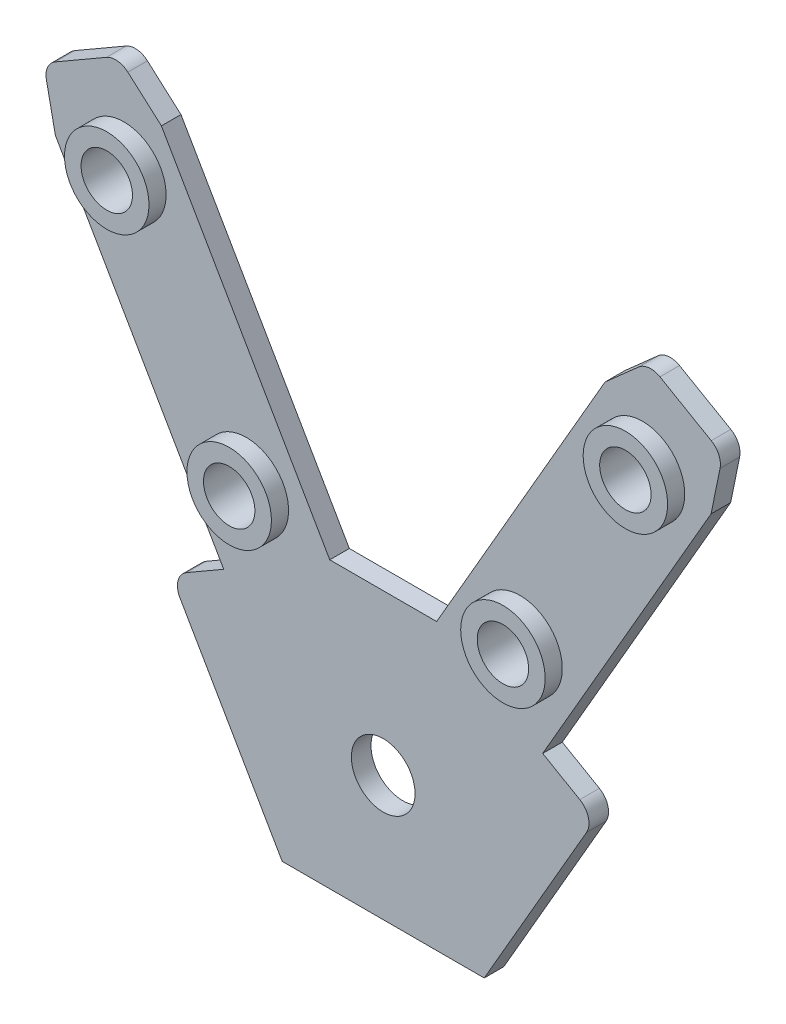
ISO-10303-21;
HEADER;
FILE_DESCRIPTION(('STEP AP214'),'2;1');
FILE_NAME('part.step','',(''),(''),'','','');
FILE_SCHEMA(('AUTOMOTIVE_DESIGN { 1 0 10303 214 1 1 1 1 }'));
ENDSEC;
DATA;
#1=APPLICATION_CONTEXT('core data for automotive mechanical design processes');
#2=APPLICATION_PROTOCOL_DEFINITION('international standard','automotive_design',2000,#1);
#3=PRODUCT_CONTEXT('',#1,'mechanical');
#4=PRODUCT('Part','Part','',(#3));
#5=PRODUCT_RELATED_PRODUCT_CATEGORY('part','',(#4));
#6=PRODUCT_DEFINITION_FORMATION('','',#4);
#7=PRODUCT_DEFINITION_CONTEXT('part definition',#1,'design');
#8=PRODUCT_DEFINITION('design','',#6,#7);
#9=PRODUCT_DEFINITION_SHAPE('','',#8);
#10=(LENGTH_UNIT() NAMED_UNIT(*) SI_UNIT(.MILLI.,.METRE.));
#11=(NAMED_UNIT(*) PLANE_ANGLE_UNIT() SI_UNIT($,.RADIAN.));
#12=(NAMED_UNIT(*) SI_UNIT($,.STERADIAN.) SOLID_ANGLE_UNIT());
#13=UNCERTAINTY_MEASURE_WITH_UNIT(LENGTH_MEASURE(1.E-05),#10,'distance_accuracy_value','');
#14=(GEOMETRIC_REPRESENTATION_CONTEXT(3) GLOBAL_UNCERTAINTY_ASSIGNED_CONTEXT((#13)) GLOBAL_UNIT_ASSIGNED_CONTEXT((#10,
#11,#12)) REPRESENTATION_CONTEXT('',''));
#15=CARTESIAN_POINT('',(0.,0.,0.));
#16=DIRECTION('',(0.,0.,1.));
#17=DIRECTION('',(1.,0.,0.));
#18=AXIS2_PLACEMENT_3D('',#15,#16,#17);
#19=CARTESIAN_POINT('',(-26.0396902753704,35.7643442304676,0.));
#20=DIRECTION('',(0.,0.,-1.));
#21=DIRECTION('',(-1.,0.,0.));
#22=AXIS2_PLACEMENT_3D('',#19,#20,#21);
#23=PLANE('',#22);
#24=CARTESIAN_POINT('',(0.,0.,0.));
#25=DIRECTION('',(0.,0.,1.));
#26=DIRECTION('',(1.,0.,0.));
#27=AXIS2_PLACEMENT_3D('',#24,#25,#26);
#28=CIRCLE('',#27,2.6);
#29=CARTESIAN_POINT('',(2.6,0.,0.));
#30=VERTEX_POINT('',#29);
#31=EDGE_CURVE('E493',#30,#30,#28,.T.);
#32=ORIENTED_EDGE('',*,*,#31,.T.);
#33=EDGE_LOOP('',(#32));
#34=FACE_BOUND('',#33,.T.);
#35=CARTESIAN_POINT('',(-26.0396902753704,35.7643442304676,0.));
#36=DIRECTION('',(0.,0.,1.));
#37=DIRECTION('',(-1.,0.,0.));
#38=AXIS2_PLACEMENT_3D('',#35,#36,#37);
#39=CIRCLE('',#38,1.5);
#40=CARTESIAN_POINT('',(-26.7896902753704,37.0633823361443,0.));
#41=VERTEX_POINT('',#40);
#42=CARTESIAN_POINT('',(-27.5092368542696,35.4636236750586,0.));
#43=VERTEX_POINT('',#42);
#44=EDGE_CURVE('E218',#41,#43,#39,.T.);
#45=ORIENTED_EDGE('',*,*,#44,.F.);
#46=DIRECTION('',(-0.866025403784442,-0.499999999999994,0.));
#47=VECTOR('',#46,1.);
#48=CARTESIAN_POINT('',(-22.6000998326207,39.4822435060601,0.));
#49=LINE('',#48,#47);
#50=CARTESIAN_POINT('',(-22.6000998326207,39.4822435060601,0.));
#51=VERTEX_POINT('',#50);
#52=EDGE_CURVE('E129',#51,#41,#49,.T.);
#53=ORIENTED_EDGE('',*,*,#52,.F.);
#54=CARTESIAN_POINT('',(-21.8500998326207,38.1832054003834,0.));
#55=DIRECTION('',(0.,0.,1.));
#56=DIRECTION('',(-1.,0.,0.));
#57=AXIS2_PLACEMENT_3D('',#54,#55,#56);
#58=CIRCLE('',#57,1.5);
#59=CARTESIAN_POINT('',(-20.8548949027467,39.3055097920501,0.));
#60=VERTEX_POINT('',#59);
#61=EDGE_CURVE('E123',#60,#51,#58,.T.);
#62=ORIENTED_EDGE('',*,*,#61,.F.);
#63=DIRECTION('',(-0.748202927777837,0.663469953249334,0.));
#64=VECTOR('',#63,1.);
#65=CARTESIAN_POINT('',(-18.1147680350733,36.8756986040721,0.));
#66=LINE('',#65,#64);
#67=CARTESIAN_POINT('',(-18.1147680350733,36.8756986040721,0.));
#68=VERTEX_POINT('',#67);
#69=EDGE_CURVE('E208',#68,#60,#66,.T.);
#70=ORIENTED_EDGE('',*,*,#69,.F.);
#71=DIRECTION('',(-0.499999999999994,0.866025403784442,0.));
#72=VECTOR('',#71,1.);
#73=CARTESIAN_POINT('',(-4.36476803507348,13.06,0.));
#74=LINE('',#73,#72);
#75=CARTESIAN_POINT('',(-4.36476803507348,13.06,0.));
#76=VERTEX_POINT('',#75);
#77=EDGE_CURVE('E256',#76,#68,#74,.T.);
#78=ORIENTED_EDGE('',*,*,#77,.F.);
#79=DIRECTION('',(-1.,0.,0.));
#80=VECTOR('',#79,1.);
#81=CARTESIAN_POINT('',(-4.36476803507348,13.06,0.));
#82=LINE('',#81,#80);
#83=CARTESIAN_POINT('',(4.36476803507348,13.06,0.));
#84=VERTEX_POINT('',#83);
#85=EDGE_CURVE('E254',#84,#76,#82,.T.);
#86=ORIENTED_EDGE('',*,*,#85,.F.);
#87=DIRECTION('',(-0.499999999999994,-0.866025403784442,0.));
#88=VECTOR('',#87,1.);
#89=CARTESIAN_POINT('',(4.36476803507348,13.06,0.));
#90=LINE('',#89,#88);
#91=CARTESIAN_POINT('',(18.1147680350733,36.8756986040721,0.));
#92=VERTEX_POINT('',#91);
#93=EDGE_CURVE('E252',#92,#84,#90,.T.);
#94=ORIENTED_EDGE('',*,*,#93,.F.);
#95=DIRECTION('',(-0.748202927777837,-0.663469953249334,0.));
#96=VECTOR('',#95,1.);
#97=CARTESIAN_POINT('',(18.1147680350733,36.8756986040721,0.));
#98=LINE('',#97,#96);
#99=CARTESIAN_POINT('',(20.8548949027467,39.3055097920501,0.));
#100=VERTEX_POINT('',#99);
#101=EDGE_CURVE('E250',#100,#92,#98,.T.);
#102=ORIENTED_EDGE('',*,*,#101,.F.);
#103=CARTESIAN_POINT('',(21.8500998326207,38.1832054003834,0.));
#104=DIRECTION('',(0.,0.,1.));
#105=DIRECTION('',(-1.,0.,0.));
#106=AXIS2_PLACEMENT_3D('',#103,#104,#105);
#107=CIRCLE('',#106,1.5);
#108=CARTESIAN_POINT('',(22.6000998326207,39.4822435060601,0.));
#109=VERTEX_POINT('',#108);
#110=EDGE_CURVE('E248',#109,#100,#107,.T.);
#111=ORIENTED_EDGE('',*,*,#110,.F.);
#112=DIRECTION('',(-0.866025403784442,0.499999999999994,0.));
#113=VECTOR('',#112,1.);
#114=CARTESIAN_POINT('',(22.6000998326207,39.4822435060601,0.));
#115=LINE('',#114,#113);
#116=CARTESIAN_POINT('',(26.7896902753704,37.0633823361443,0.));
#117=VERTEX_POINT('',#116);
#118=EDGE_CURVE('E246',#117,#109,#115,.T.);
#119=ORIENTED_EDGE('',*,*,#118,.F.);
#120=CARTESIAN_POINT('',(26.0396902753704,35.7643442304676,0.));
#121=DIRECTION('',(0.,0.,1.));
#122=DIRECTION('',(1.,0.,0.));
#123=AXIS2_PLACEMENT_3D('',#120,#121,#122);
#124=CIRCLE('',#123,1.5);
#125=CARTESIAN_POINT('',(27.5092368542696,35.4636236750586,0.));
#126=VERTEX_POINT('',#125);
#127=EDGE_CURVE('E244',#126,#117,#124,.T.);
#128=ORIENTED_EDGE('',*,*,#127,.F.);
#129=DIRECTION('',(0.200480370272667,0.97969771926617,0.));
#130=VECTOR('',#129,1.);
#131=CARTESIAN_POINT('',(26.7750220729177,31.8756986040722,0.));
#132=LINE('',#131,#130);
#133=CARTESIAN_POINT('',(26.7750220729177,31.8756986040722,0.));
#134=VERTEX_POINT('',#133);
#135=EDGE_CURVE('E242',#134,#126,#132,.T.);
#136=ORIENTED_EDGE('',*,*,#135,.F.);
#137=DIRECTION('',(0.499999999999995,0.866025403784442,0.));
#138=VECTOR('',#137,1.);
#139=CARTESIAN_POINT('',(13.0250220729179,8.06000000000005,0.));
#140=LINE('',#139,#138);
#141=CARTESIAN_POINT('',(13.0250220729179,8.06000000000005,0.));
#142=VERTEX_POINT('',#141);
#143=EDGE_CURVE('E240',#142,#134,#140,.T.);
#144=ORIENTED_EDGE('',*,*,#143,.F.);
#145=DIRECTION('',(-0.866025403784441,0.499999999999996,0.));
#146=VECTOR('',#145,1.);
#147=CARTESIAN_POINT('',(13.0250220729179,8.06000000000005,0.));
#148=LINE('',#147,#146);
#149=CARTESIAN_POINT('',(16.0561109861634,6.31000000000007,0.));
#150=VERTEX_POINT('',#149);
#151=EDGE_CURVE('E238',#150,#142,#148,.T.);
#152=ORIENTED_EDGE('',*,*,#151,.F.);
#153=CARTESIAN_POINT('',(15.3061109861634,5.01096189432341,0.));
#154=DIRECTION('',(0.,0.,1.));
#155=DIRECTION('',(-1.,0.,0.));
#156=AXIS2_PLACEMENT_3D('',#153,#154,#155);
#157=CIRCLE('',#156,1.49999999999999);
#158=CARTESIAN_POINT('',(16.6051490918401,4.26096189432342,0.));
#159=VERTEX_POINT('',#158);
#160=EDGE_CURVE('E236',#159,#150,#157,.T.);
#161=ORIENTED_EDGE('',*,*,#160,.F.);
#162=DIRECTION('',(0.499999999999994,0.866025403784442,0.));
#163=VECTOR('',#162,1.);
#164=CARTESIAN_POINT('',(16.6051490918401,4.26096189432342,0.));
#165=LINE('',#164,#163);
#166=CARTESIAN_POINT('',(8.2503353467198,-10.21,0.));
#167=VERTEX_POINT('',#166);
#168=EDGE_CURVE('E234',#167,#159,#165,.T.);
#169=ORIENTED_EDGE('',*,*,#168,.F.);
#170=DIRECTION('',(1.,0.,0.));
#171=VECTOR('',#170,1.);
#172=CARTESIAN_POINT('',(8.2503353467198,-10.21,0.));
#173=LINE('',#172,#171);
#174=CARTESIAN_POINT('',(-8.25033534671979,-10.21,0.));
#175=VERTEX_POINT('',#174);
#176=EDGE_CURVE('E232',#175,#167,#173,.T.);
#177=ORIENTED_EDGE('',*,*,#176,.F.);
#178=DIRECTION('',(0.499999999999995,-0.866025403784441,0.));
#179=VECTOR('',#178,1.);
#180=CARTESIAN_POINT('',(-16.6051490918401,4.26096189432341,0.));
#181=LINE('',#180,#179);
#182=CARTESIAN_POINT('',(-16.6051490918401,4.26096189432341,0.));
#183=VERTEX_POINT('',#182);
#184=EDGE_CURVE('E230',#183,#175,#181,.T.);
#185=ORIENTED_EDGE('',*,*,#184,.F.);
#186=CARTESIAN_POINT('',(-15.3061109861635,5.01096189432341,0.));
#187=DIRECTION('',(0.,0.,1.));
#188=DIRECTION('',(-1.,0.,0.));
#189=AXIS2_PLACEMENT_3D('',#186,#187,#188);
#190=CIRCLE('',#189,1.5);
#191=CARTESIAN_POINT('',(-16.0561109861634,6.31000000000008,0.));
#192=VERTEX_POINT('',#191);
#193=EDGE_CURVE('E228',#192,#183,#190,.T.);
#194=ORIENTED_EDGE('',*,*,#193,.F.);
#195=DIRECTION('',(-0.866025403784442,-0.499999999999994,0.));
#196=VECTOR('',#195,1.);
#197=CARTESIAN_POINT('',(-13.0250220729179,8.06000000000005,0.));
#198=LINE('',#197,#196);
#199=CARTESIAN_POINT('',(-13.0250220729179,8.06000000000005,0.));
#200=VERTEX_POINT('',#199);
#201=EDGE_CURVE('E226',#200,#192,#198,.T.);
#202=ORIENTED_EDGE('',*,*,#201,.F.);
#203=DIRECTION('',(0.499999999999995,-0.866025403784442,0.));
#204=VECTOR('',#203,1.);
#205=CARTESIAN_POINT('',(-13.0250220729179,8.06000000000005,0.));
#206=LINE('',#205,#204);
#207=CARTESIAN_POINT('',(-26.7750220729177,31.8756986040722,0.));
#208=VERTEX_POINT('',#207);
#209=EDGE_CURVE('E224',#208,#200,#206,.T.);
#210=ORIENTED_EDGE('',*,*,#209,.F.);
#211=DIRECTION('',(0.200480370272667,-0.979697719266169,0.));
#212=VECTOR('',#211,1.);
#213=CARTESIAN_POINT('',(-26.7750220729177,31.8756986040722,0.));
#214=LINE('',#213,#212);
#215=EDGE_CURVE('E221',#43,#208,#214,.T.);
#216=ORIENTED_EDGE('',*,*,#215,.F.);
#217=EDGE_LOOP('',(#45,#53,#62,#70,#78,#86,#94,#102,#111,#119,#128,#136,#144,#152,#161,#169,
#177,#185,#194,#202,#210,#216));
#218=FACE_BOUND('',#217,.T.);
#219=CARTESIAN_POINT('',(-21.1785571585147,32.1823370295497,0.));
#220=DIRECTION('',(0.,0.,1.));
#221=DIRECTION('',(1.,0.,0.));
#222=AXIS2_PLACEMENT_3D('',#219,#220,#221);
#223=CIRCLE('',#222,2.1);
#224=CARTESIAN_POINT('',(-19.0785571585147,32.1823370295497,0.));
#225=VERTEX_POINT('',#224);
#226=EDGE_CURVE('E509',#225,#225,#223,.T.);
#227=ORIENTED_EDGE('',*,*,#226,.T.);
#228=EDGE_LOOP('',(#227));
#229=FACE_BOUND('',#228,.T.);
#230=CARTESIAN_POINT('',(-11.1785571585147,14.8618289538609,0.));
#231=DIRECTION('',(0.,0.,1.));
#232=DIRECTION('',(1.,0.,0.));
#233=AXIS2_PLACEMENT_3D('',#230,#231,#232);
#234=CIRCLE('',#233,2.1);
#235=CARTESIAN_POINT('',(-9.07855715851474,14.8618289538609,0.));
#236=VERTEX_POINT('',#235);
#237=EDGE_CURVE('E515',#236,#236,#234,.T.);
#238=ORIENTED_EDGE('',*,*,#237,.T.);
#239=EDGE_LOOP('',(#238));
#240=FACE_BOUND('',#239,.T.);
#241=CARTESIAN_POINT('',(11.1785571585147,14.8618289538609,0.));
#242=DIRECTION('',(0.,0.,1.));
#243=DIRECTION('',(1.,0.,0.));
#244=AXIS2_PLACEMENT_3D('',#241,#242,#243);
#245=CIRCLE('',#244,2.1);
#246=CARTESIAN_POINT('',(13.2785571585147,14.8618289538609,0.));
#247=VERTEX_POINT('',#246);
#248=EDGE_CURVE('E521',#247,#247,#245,.T.);
#249=ORIENTED_EDGE('',*,*,#248,.T.);
#250=EDGE_LOOP('',(#249));
#251=FACE_BOUND('',#250,.T.);
#252=CARTESIAN_POINT('',(21.1785571585147,32.1823370295497,0.));
#253=DIRECTION('',(0.,0.,1.));
#254=DIRECTION('',(1.,0.,0.));
#255=AXIS2_PLACEMENT_3D('',#252,#253,#254);
#256=CIRCLE('',#255,2.1);
#257=CARTESIAN_POINT('',(23.2785571585148,32.1823370295497,0.));
#258=VERTEX_POINT('',#257);
#259=EDGE_CURVE('E527',#258,#258,#256,.T.);
#260=ORIENTED_EDGE('',*,*,#259,.T.);
#261=EDGE_LOOP('',(#260));
#262=FACE_BOUND('',#261,.T.);
#263=ADVANCED_FACE('F35',(#34,#218,#229,#240,#251,#262),#23,.T.);
#264=CARTESIAN_POINT('',(-26.0396902753704,35.7643442304676,1.6));
#265=DIRECTION('',(0.,0.,-1.));
#266=DIRECTION('',(-1.,0.,0.));
#267=AXIS2_PLACEMENT_3D('',#264,#265,#266);
#268=PLANE('',#267);
#269=CARTESIAN_POINT('',(-11.1785571585147,14.8618289538609,1.6));
#270=DIRECTION('',(0.,0.,-1.));
#271=DIRECTION('',(-1.,0.,0.));
#272=AXIS2_PLACEMENT_3D('',#269,#270,#271);
#273=CIRCLE('',#272,3.45);
#274=CARTESIAN_POINT('',(-14.6285571585147,14.8618289538609,1.6));
#275=VERTEX_POINT('',#274);
#276=EDGE_CURVE('E44',#275,#275,#273,.F.);
#277=ORIENTED_EDGE('',*,*,#276,.F.);
#278=EDGE_LOOP('',(#277));
#279=FACE_BOUND('',#278,.T.);
#280=CARTESIAN_POINT('',(21.1785571585147,32.1823370295497,1.6));
#281=DIRECTION('',(0.,0.,-1.));
#282=DIRECTION('',(-1.,0.,0.));
#283=AXIS2_PLACEMENT_3D('',#280,#281,#282);
#284=CIRCLE('',#283,3.45);
#285=CARTESIAN_POINT('',(17.7285571585148,32.1823370295497,1.6));
#286=VERTEX_POINT('',#285);
#287=EDGE_CURVE('E318',#286,#286,#284,.F.);
#288=ORIENTED_EDGE('',*,*,#287,.F.);
#289=EDGE_LOOP('',(#288));
#290=FACE_BOUND('',#289,.T.);
#291=CARTESIAN_POINT('',(-26.0396902753704,35.7643442304676,1.6));
#292=DIRECTION('',(0.,0.,1.));
#293=DIRECTION('',(-1.,0.,0.));
#294=AXIS2_PLACEMENT_3D('',#291,#292,#293);
#295=CIRCLE('',#294,1.5);
#296=CARTESIAN_POINT('',(-26.7896902753704,37.0633823361443,1.6));
#297=VERTEX_POINT('',#296);
#298=CARTESIAN_POINT('',(-27.5092368542696,35.4636236750586,1.6));
#299=VERTEX_POINT('',#298);
#300=EDGE_CURVE('E261',#297,#299,#295,.T.);
#301=ORIENTED_EDGE('',*,*,#300,.T.);
#302=DIRECTION('',(0.200480370272667,-0.979697719266169,0.));
#303=VECTOR('',#302,1.);
#304=CARTESIAN_POINT('',(-26.7750220729177,31.8756986040722,1.6));
#305=LINE('',#304,#303);
#306=CARTESIAN_POINT('',(-26.7750220729177,31.8756986040722,1.6));
#307=VERTEX_POINT('',#306);
#308=EDGE_CURVE('E138',#299,#307,#305,.T.);
#309=ORIENTED_EDGE('',*,*,#308,.T.);
#310=DIRECTION('',(0.499999999999995,-0.866025403784442,0.));
#311=VECTOR('',#310,1.);
#312=CARTESIAN_POINT('',(-13.0250220729179,8.06000000000005,1.6));
#313=LINE('',#312,#311);
#314=CARTESIAN_POINT('',(-13.0250220729179,8.06000000000005,1.6));
#315=VERTEX_POINT('',#314);
#316=EDGE_CURVE('E442',#307,#315,#313,.T.);
#317=ORIENTED_EDGE('',*,*,#316,.T.);
#318=DIRECTION('',(-0.866025403784442,-0.499999999999994,0.));
#319=VECTOR('',#318,1.);
#320=CARTESIAN_POINT('',(-13.0250220729179,8.06000000000005,1.6));
#321=LINE('',#320,#319);
#322=CARTESIAN_POINT('',(-16.0561109861634,6.31000000000008,1.6));
#323=VERTEX_POINT('',#322);
#324=EDGE_CURVE('E454',#315,#323,#321,.T.);
#325=ORIENTED_EDGE('',*,*,#324,.T.);
#326=CARTESIAN_POINT('',(-15.3061109861635,5.01096189432341,1.6));
#327=DIRECTION('',(0.,0.,1.));
#328=DIRECTION('',(-1.,0.,0.));
#329=AXIS2_PLACEMENT_3D('',#326,#327,#328);
#330=CIRCLE('',#329,1.5);
#331=CARTESIAN_POINT('',(-16.6051490918401,4.26096189432341,1.6));
#332=VERTEX_POINT('',#331);
#333=EDGE_CURVE('E451',#323,#332,#330,.T.);
#334=ORIENTED_EDGE('',*,*,#333,.T.);
#335=DIRECTION('',(0.499999999999995,-0.866025403784441,0.));
#336=VECTOR('',#335,1.);
#337=CARTESIAN_POINT('',(-16.6051490918401,4.26096189432341,1.6));
#338=LINE('',#337,#336);
#339=CARTESIAN_POINT('',(-8.25033534671979,-10.21,1.6));
#340=VERTEX_POINT('',#339);
#341=EDGE_CURVE('E453',#332,#340,#338,.T.);
#342=ORIENTED_EDGE('',*,*,#341,.T.);
#343=DIRECTION('',(1.,0.,0.));
#344=VECTOR('',#343,1.);
#345=CARTESIAN_POINT('',(8.2503353467198,-10.21,1.6));
#346=LINE('',#345,#344);
#347=CARTESIAN_POINT('',(8.2503353467198,-10.21,1.6));
#348=VERTEX_POINT('',#347);
#349=EDGE_CURVE('E456',#340,#348,#346,.T.);
#350=ORIENTED_EDGE('',*,*,#349,.T.);
#351=DIRECTION('',(0.499999999999994,0.866025403784442,0.));
#352=VECTOR('',#351,1.);
#353=CARTESIAN_POINT('',(16.6051490918401,4.26096189432342,1.6));
#354=LINE('',#353,#352);
#355=CARTESIAN_POINT('',(16.6051490918401,4.26096189432342,1.6));
#356=VERTEX_POINT('',#355);
#357=EDGE_CURVE('E462',#348,#356,#354,.T.);
#358=ORIENTED_EDGE('',*,*,#357,.T.);
#359=CARTESIAN_POINT('',(15.3061109861634,5.01096189432341,1.6));
#360=DIRECTION('',(0.,0.,1.));
#361=DIRECTION('',(-1.,0.,0.));
#362=AXIS2_PLACEMENT_3D('',#359,#360,#361);
#363=CIRCLE('',#362,1.49999999999999);
#364=CARTESIAN_POINT('',(16.0561109861634,6.31000000000007,1.6));
#365=VERTEX_POINT('',#364);
#366=EDGE_CURVE('E464',#356,#365,#363,.T.);
#367=ORIENTED_EDGE('',*,*,#366,.T.);
#368=DIRECTION('',(-0.866025403784441,0.499999999999996,0.));
#369=VECTOR('',#368,1.);
#370=CARTESIAN_POINT('',(13.0250220729179,8.06000000000005,1.6));
#371=LINE('',#370,#369);
#372=CARTESIAN_POINT('',(13.0250220729179,8.06000000000005,1.6));
#373=VERTEX_POINT('',#372);
#374=EDGE_CURVE('E466',#365,#373,#371,.T.);
#375=ORIENTED_EDGE('',*,*,#374,.T.);
#376=DIRECTION('',(0.499999999999995,0.866025403784442,0.));
#377=VECTOR('',#376,1.);
#378=CARTESIAN_POINT('',(13.0250220729179,8.06000000000005,1.6));
#379=LINE('',#378,#377);
#380=CARTESIAN_POINT('',(26.7750220729177,31.8756986040722,1.6));
#381=VERTEX_POINT('',#380);
#382=EDGE_CURVE('E468',#373,#381,#379,.T.);
#383=ORIENTED_EDGE('',*,*,#382,.T.);
#384=DIRECTION('',(0.200480370272667,0.97969771926617,0.));
#385=VECTOR('',#384,1.);
#386=CARTESIAN_POINT('',(26.7750220729177,31.8756986040722,1.6));
#387=LINE('',#386,#385);
#388=CARTESIAN_POINT('',(27.5092368542696,35.4636236750586,1.6));
#389=VERTEX_POINT('',#388);
#390=EDGE_CURVE('E470',#381,#389,#387,.T.);
#391=ORIENTED_EDGE('',*,*,#390,.T.);
#392=CARTESIAN_POINT('',(26.0396902753704,35.7643442304676,1.6));
#393=DIRECTION('',(0.,0.,1.));
#394=DIRECTION('',(1.,0.,0.));
#395=AXIS2_PLACEMENT_3D('',#392,#393,#394);
#396=CIRCLE('',#395,1.5);
#397=CARTESIAN_POINT('',(26.7896902753704,37.0633823361443,1.6));
#398=VERTEX_POINT('',#397);
#399=EDGE_CURVE('E472',#389,#398,#396,.T.);
#400=ORIENTED_EDGE('',*,*,#399,.T.);
#401=DIRECTION('',(-0.866025403784442,0.499999999999994,0.));
#402=VECTOR('',#401,1.);
#403=CARTESIAN_POINT('',(22.6000998326207,39.4822435060601,1.6));
#404=LINE('',#403,#402);
#405=CARTESIAN_POINT('',(22.6000998326207,39.4822435060601,1.6));
#406=VERTEX_POINT('',#405);
#407=EDGE_CURVE('E474',#398,#406,#404,.T.);
#408=ORIENTED_EDGE('',*,*,#407,.T.);
#409=CARTESIAN_POINT('',(21.8500998326207,38.1832054003834,1.6));
#410=DIRECTION('',(0.,0.,1.));
#411=DIRECTION('',(-1.,0.,0.));
#412=AXIS2_PLACEMENT_3D('',#409,#410,#411);
#413=CIRCLE('',#412,1.5);
#414=CARTESIAN_POINT('',(20.8548949027467,39.3055097920501,1.6));
#415=VERTEX_POINT('',#414);
#416=EDGE_CURVE('E476',#406,#415,#413,.T.);
#417=ORIENTED_EDGE('',*,*,#416,.T.);
#418=DIRECTION('',(-0.748202927777837,-0.663469953249334,0.));
#419=VECTOR('',#418,1.);
#420=CARTESIAN_POINT('',(18.1147680350733,36.8756986040721,1.6));
#421=LINE('',#420,#419);
#422=CARTESIAN_POINT('',(18.1147680350733,36.8756986040721,1.6));
#423=VERTEX_POINT('',#422);
#424=EDGE_CURVE('E478',#415,#423,#421,.T.);
#425=ORIENTED_EDGE('',*,*,#424,.T.);
#426=DIRECTION('',(-0.499999999999994,-0.866025403784442,0.));
#427=VECTOR('',#426,1.);
#428=CARTESIAN_POINT('',(4.36476803507348,13.06,1.6));
#429=LINE('',#428,#427);
#430=CARTESIAN_POINT('',(4.36476803507348,13.06,1.6));
#431=VERTEX_POINT('',#430);
#432=EDGE_CURVE('E480',#423,#431,#429,.T.);
#433=ORIENTED_EDGE('',*,*,#432,.T.);
#434=DIRECTION('',(-1.,0.,0.));
#435=VECTOR('',#434,1.);
#436=CARTESIAN_POINT('',(-4.36476803507348,13.06,1.6));
#437=LINE('',#436,#435);
#438=CARTESIAN_POINT('',(-4.36476803507348,13.06,1.6));
#439=VERTEX_POINT('',#438);
#440=EDGE_CURVE('E482',#431,#439,#437,.T.);
#441=ORIENTED_EDGE('',*,*,#440,.T.);
#442=DIRECTION('',(-0.499999999999994,0.866025403784442,0.));
#443=VECTOR('',#442,1.);
#444=CARTESIAN_POINT('',(-4.36476803507348,13.06,1.6));
#445=LINE('',#444,#443);
#446=CARTESIAN_POINT('',(-18.1147680350733,36.8756986040721,1.6));
#447=VERTEX_POINT('',#446);
#448=EDGE_CURVE('E200',#439,#447,#445,.T.);
#449=ORIENTED_EDGE('',*,*,#448,.T.);
#450=DIRECTION('',(-0.748202927777837,0.663469953249334,0.));
#451=VECTOR('',#450,1.);
#452=CARTESIAN_POINT('',(-18.1147680350733,36.8756986040721,1.6));
#453=LINE('',#452,#451);
#454=CARTESIAN_POINT('',(-20.8548949027467,39.3055097920501,1.6));
#455=VERTEX_POINT('',#454);
#456=EDGE_CURVE('E193',#447,#455,#453,.T.);
#457=ORIENTED_EDGE('',*,*,#456,.T.);
#458=CARTESIAN_POINT('',(-21.8500998326207,38.1832054003834,1.6));
#459=DIRECTION('',(0.,0.,1.));
#460=DIRECTION('',(-1.,0.,0.));
#461=AXIS2_PLACEMENT_3D('',#458,#459,#460);
#462=CIRCLE('',#461,1.5);
#463=CARTESIAN_POINT('',(-22.6000998326207,39.4822435060601,1.6));
#464=VERTEX_POINT('',#463);
#465=EDGE_CURVE('E198',#455,#464,#462,.T.);
#466=ORIENTED_EDGE('',*,*,#465,.T.);
#467=DIRECTION('',(-0.866025403784442,-0.499999999999994,0.));
#468=VECTOR('',#467,1.);
#469=CARTESIAN_POINT('',(-22.6000998326207,39.4822435060601,1.6));
#470=LINE('',#469,#468);
#471=EDGE_CURVE('E52',#464,#297,#470,.T.);
#472=ORIENTED_EDGE('',*,*,#471,.T.);
#473=EDGE_LOOP('',(#301,#309,#317,#325,#334,#342,#350,#358,#367,#375,#383,#391,#400,#408,#417,
#425,#433,#441,#449,#457,#466,#472));
#474=FACE_BOUND('',#473,.T.);
#475=CARTESIAN_POINT('',(0.,0.,1.6));
#476=DIRECTION('',(0.,0.,1.));
#477=DIRECTION('',(1.,0.,0.));
#478=AXIS2_PLACEMENT_3D('',#475,#476,#477);
#479=CIRCLE('',#478,2.6);
#480=CARTESIAN_POINT('',(2.6,0.,1.6));
#481=VERTEX_POINT('',#480);
#482=EDGE_CURVE('E222',#481,#481,#479,.T.);
#483=ORIENTED_EDGE('',*,*,#482,.F.);
#484=EDGE_LOOP('',(#483));
#485=FACE_BOUND('',#484,.T.);
#486=CARTESIAN_POINT('',(11.1785571585147,14.8618289538609,1.6));
#487=DIRECTION('',(0.,0.,-1.));
#488=DIRECTION('',(-1.,0.,0.));
#489=AXIS2_PLACEMENT_3D('',#486,#487,#488);
#490=CIRCLE('',#489,3.45);
#491=CARTESIAN_POINT('',(7.72855715851474,14.8618289538609,1.6));
#492=VERTEX_POINT('',#491);
#493=EDGE_CURVE('E321',#492,#492,#490,.F.);
#494=ORIENTED_EDGE('',*,*,#493,.F.);
#495=EDGE_LOOP('',(#494));
#496=FACE_BOUND('',#495,.T.);
#497=CARTESIAN_POINT('',(-21.1785571585147,32.1823370295497,1.6));
#498=DIRECTION('',(0.,0.,-1.));
#499=DIRECTION('',(-1.,0.,0.));
#500=AXIS2_PLACEMENT_3D('',#497,#498,#499);
#501=CIRCLE('',#500,3.45);
#502=CARTESIAN_POINT('',(-24.6285571585148,32.1823370295497,1.6));
#503=VERTEX_POINT('',#502);
#504=EDGE_CURVE('E11',#503,#503,#501,.F.);
#505=ORIENTED_EDGE('',*,*,#504,.F.);
#506=EDGE_LOOP('',(#505));
#507=FACE_BOUND('',#506,.T.);
#508=ADVANCED_FACE('F195',(#279,#290,#474,#485,#496,#507),#268,.F.);
#509=CARTESIAN_POINT('',(-26.0396902753704,35.7643442304676,1.6));
#510=DIRECTION('',(0.,0.,-1.));
#511=DIRECTION('',(-1.,0.,0.));
#512=AXIS2_PLACEMENT_3D('',#509,#510,#511);
#513=CYLINDRICAL_SURFACE('',#512,1.5);
#514=ORIENTED_EDGE('',*,*,#44,.T.);
#515=DIRECTION('',(0.,0.,-1.));
#516=VECTOR('',#515,1.);
#517=CARTESIAN_POINT('',(-27.5092368542696,35.4636236750586,1.6));
#518=LINE('',#517,#516);
#519=EDGE_CURVE('E316',#299,#43,#518,.T.);
#520=ORIENTED_EDGE('',*,*,#519,.F.);
#521=ORIENTED_EDGE('',*,*,#300,.F.);
#522=DIRECTION('',(0.,0.,-1.));
#523=VECTOR('',#522,1.);
#524=CARTESIAN_POINT('',(-26.7896902753704,37.0633823361443,1.6));
#525=LINE('',#524,#523);
#526=EDGE_CURVE('E214',#297,#41,#525,.T.);
#527=ORIENTED_EDGE('',*,*,#526,.T.);
#528=EDGE_LOOP('',(#514,#520,#521,#527));
#529=FACE_BOUND('',#528,.T.);
#530=ADVANCED_FACE('F37',(#529),#513,.T.);
#531=CARTESIAN_POINT('',(-26.7750220729177,31.8756986040722,1.6));
#532=DIRECTION('',(0.979697719266169,0.200480370272667,0.));
#533=DIRECTION('',(-0.200480370272667,0.97969771926617,0.));
#534=AXIS2_PLACEMENT_3D('',#531,#532,#533);
#535=PLANE('',#534);
#536=ORIENTED_EDGE('',*,*,#215,.T.);
#537=DIRECTION('',(0.,0.,-1.));
#538=VECTOR('',#537,1.);
#539=CARTESIAN_POINT('',(-26.7750220729177,31.8756986040722,1.6));
#540=LINE('',#539,#538);
#541=EDGE_CURVE('E313',#307,#208,#540,.T.);
#542=ORIENTED_EDGE('',*,*,#541,.F.);
#543=ORIENTED_EDGE('',*,*,#308,.F.);
#544=ORIENTED_EDGE('',*,*,#519,.T.);
#545=EDGE_LOOP('',(#536,#542,#543,#544));
#546=FACE_BOUND('',#545,.T.);
#547=ADVANCED_FACE('F430',(#546),#535,.F.);
#548=CARTESIAN_POINT('',(-13.0250220729179,8.06000000000005,1.6));
#549=DIRECTION('',(0.866025403784442,0.499999999999995,0.));
#550=DIRECTION('',(-0.499999999999995,0.866025403784442,0.));
#551=AXIS2_PLACEMENT_3D('',#548,#549,#550);
#552=PLANE('',#551);
#553=ORIENTED_EDGE('',*,*,#209,.T.);
#554=DIRECTION('',(0.,0.,-1.));
#555=VECTOR('',#554,1.);
#556=CARTESIAN_POINT('',(-13.0250220729179,8.06000000000005,1.6));
#557=LINE('',#556,#555);
#558=EDGE_CURVE('E310',#315,#200,#557,.T.);
#559=ORIENTED_EDGE('',*,*,#558,.F.);
#560=ORIENTED_EDGE('',*,*,#316,.F.);
#561=ORIENTED_EDGE('',*,*,#541,.T.);
#562=EDGE_LOOP('',(#553,#559,#560,#561));
#563=FACE_BOUND('',#562,.T.);
#564=ADVANCED_FACE('F427',(#563),#552,.F.);
#565=CARTESIAN_POINT('',(-13.0250220729179,8.06000000000005,1.6));
#566=DIRECTION('',(0.499999999999994,-0.866025403784442,0.));
#567=DIRECTION('',(0.866025403784442,0.499999999999994,0.));
#568=AXIS2_PLACEMENT_3D('',#565,#566,#567);
#569=PLANE('',#568);
#570=ORIENTED_EDGE('',*,*,#201,.T.);
#571=DIRECTION('',(0.,0.,-1.));
#572=VECTOR('',#571,1.);
#573=CARTESIAN_POINT('',(-16.0561109861634,6.31000000000008,1.6));
#574=LINE('',#573,#572);
#575=EDGE_CURVE('E307',#323,#192,#574,.T.);
#576=ORIENTED_EDGE('',*,*,#575,.F.);
#577=ORIENTED_EDGE('',*,*,#324,.F.);
#578=ORIENTED_EDGE('',*,*,#558,.T.);
#579=EDGE_LOOP('',(#570,#576,#577,#578));
#580=FACE_BOUND('',#579,.T.);
#581=ADVANCED_FACE('F423',(#580),#569,.F.);
#582=CARTESIAN_POINT('',(-15.3061109861635,5.01096189432341,1.6));
#583=DIRECTION('',(0.,0.,-1.));
#584=DIRECTION('',(-1.,0.,0.));
#585=AXIS2_PLACEMENT_3D('',#582,#583,#584);
#586=CYLINDRICAL_SURFACE('',#585,1.5);
#587=ORIENTED_EDGE('',*,*,#193,.T.);
#588=DIRECTION('',(0.,0.,-1.));
#589=VECTOR('',#588,1.);
#590=CARTESIAN_POINT('',(-16.6051490918401,4.26096189432341,1.6));
#591=LINE('',#590,#589);
#592=EDGE_CURVE('E304',#332,#183,#591,.T.);
#593=ORIENTED_EDGE('',*,*,#592,.F.);
#594=ORIENTED_EDGE('',*,*,#333,.F.);
#595=ORIENTED_EDGE('',*,*,#575,.T.);
#596=EDGE_LOOP('',(#587,#593,#594,#595));
#597=FACE_BOUND('',#596,.T.);
#598=ADVANCED_FACE('F419',(#597),#586,.T.);
#599=CARTESIAN_POINT('',(-16.6051490918401,4.26096189432341,1.6));
#600=DIRECTION('',(0.866025403784441,0.499999999999995,0.));
#601=DIRECTION('',(-0.499999999999995,0.866025403784441,0.));
#602=AXIS2_PLACEMENT_3D('',#599,#600,#601);
#603=PLANE('',#602);
#604=ORIENTED_EDGE('',*,*,#184,.T.);
#605=DIRECTION('',(0.,0.,-1.));
#606=VECTOR('',#605,1.);
#607=CARTESIAN_POINT('',(-8.25033534671979,-10.21,1.6));
#608=LINE('',#607,#606);
#609=EDGE_CURVE('E301',#340,#175,#608,.T.);
#610=ORIENTED_EDGE('',*,*,#609,.F.);
#611=ORIENTED_EDGE('',*,*,#341,.F.);
#612=ORIENTED_EDGE('',*,*,#592,.T.);
#613=EDGE_LOOP('',(#604,#610,#611,#612));
#614=FACE_BOUND('',#613,.T.);
#615=ADVANCED_FACE('F415',(#614),#603,.F.);
#616=CARTESIAN_POINT('',(8.2503353467198,-10.21,1.6));
#617=DIRECTION('',(0.,1.,0.));
#618=DIRECTION('',(0.,0.,1.));
#619=AXIS2_PLACEMENT_3D('',#616,#617,#618);
#620=PLANE('',#619);
#621=ORIENTED_EDGE('',*,*,#176,.T.);
#622=DIRECTION('',(0.,0.,-1.));
#623=VECTOR('',#622,1.);
#624=CARTESIAN_POINT('',(8.2503353467198,-10.21,1.6));
#625=LINE('',#624,#623);
#626=EDGE_CURVE('E298',#348,#167,#625,.T.);
#627=ORIENTED_EDGE('',*,*,#626,.F.);
#628=ORIENTED_EDGE('',*,*,#349,.F.);
#629=ORIENTED_EDGE('',*,*,#609,.T.);
#630=EDGE_LOOP('',(#621,#627,#628,#629));
#631=FACE_BOUND('',#630,.T.);
#632=ADVANCED_FACE('F411',(#631),#620,.F.);
#633=CARTESIAN_POINT('',(16.6051490918401,4.26096189432342,1.6));
#634=DIRECTION('',(-0.866025403784442,0.499999999999994,0.));
#635=DIRECTION('',(-0.499999999999994,-0.866025403784442,0.));
#636=AXIS2_PLACEMENT_3D('',#633,#634,#635);
#637=PLANE('',#636);
#638=ORIENTED_EDGE('',*,*,#168,.T.);
#639=DIRECTION('',(0.,0.,-1.));
#640=VECTOR('',#639,1.);
#641=CARTESIAN_POINT('',(16.6051490918401,4.26096189432342,1.6));
#642=LINE('',#641,#640);
#643=EDGE_CURVE('E295',#356,#159,#642,.T.);
#644=ORIENTED_EDGE('',*,*,#643,.F.);
#645=ORIENTED_EDGE('',*,*,#357,.F.);
#646=ORIENTED_EDGE('',*,*,#626,.T.);
#647=EDGE_LOOP('',(#638,#644,#645,#646));
#648=FACE_BOUND('',#647,.T.);
#649=ADVANCED_FACE('F407',(#648),#637,.F.);
#650=CARTESIAN_POINT('',(15.3061109861634,5.01096189432341,1.6));
#651=DIRECTION('',(0.,0.,-1.));
#652=DIRECTION('',(-1.,0.,0.));
#653=AXIS2_PLACEMENT_3D('',#650,#651,#652);
#654=CYLINDRICAL_SURFACE('',#653,1.49999999999999);
#655=ORIENTED_EDGE('',*,*,#160,.T.);
#656=DIRECTION('',(0.,0.,-1.));
#657=VECTOR('',#656,1.);
#658=CARTESIAN_POINT('',(16.0561109861634,6.31000000000007,1.6));
#659=LINE('',#658,#657);
#660=EDGE_CURVE('E292',#365,#150,#659,.T.);
#661=ORIENTED_EDGE('',*,*,#660,.F.);
#662=ORIENTED_EDGE('',*,*,#366,.F.);
#663=ORIENTED_EDGE('',*,*,#643,.T.);
#664=EDGE_LOOP('',(#655,#661,#662,#663));
#665=FACE_BOUND('',#664,.T.);
#666=ADVANCED_FACE('F403',(#665),#654,.T.);
#667=CARTESIAN_POINT('',(13.0250220729179,8.06000000000005,1.6));
#668=DIRECTION('',(-0.499999999999996,-0.866025403784441,0.));
#669=DIRECTION('',(0.866025403784441,-0.499999999999996,0.));
#670=AXIS2_PLACEMENT_3D('',#667,#668,#669);
#671=PLANE('',#670);
#672=ORIENTED_EDGE('',*,*,#151,.T.);
#673=DIRECTION('',(0.,0.,-1.));
#674=VECTOR('',#673,1.);
#675=CARTESIAN_POINT('',(13.0250220729179,8.06000000000005,1.6));
#676=LINE('',#675,#674);
#677=EDGE_CURVE('E289',#373,#142,#676,.T.);
#678=ORIENTED_EDGE('',*,*,#677,.F.);
#679=ORIENTED_EDGE('',*,*,#374,.F.);
#680=ORIENTED_EDGE('',*,*,#660,.T.);
#681=EDGE_LOOP('',(#672,#678,#679,#680));
#682=FACE_BOUND('',#681,.T.);
#683=ADVANCED_FACE('F399',(#682),#671,.F.);
#684=CARTESIAN_POINT('',(13.0250220729179,8.06000000000005,1.6));
#685=DIRECTION('',(-0.866025403784442,0.499999999999995,0.));
#686=DIRECTION('',(-0.499999999999995,-0.866025403784442,0.));
#687=AXIS2_PLACEMENT_3D('',#684,#685,#686);
#688=PLANE('',#687);
#689=ORIENTED_EDGE('',*,*,#143,.T.);
#690=DIRECTION('',(0.,0.,-1.));
#691=VECTOR('',#690,1.);
#692=CARTESIAN_POINT('',(26.7750220729177,31.8756986040722,1.6));
#693=LINE('',#692,#691);
#694=EDGE_CURVE('E286',#381,#134,#693,.T.);
#695=ORIENTED_EDGE('',*,*,#694,.F.);
#696=ORIENTED_EDGE('',*,*,#382,.F.);
#697=ORIENTED_EDGE('',*,*,#677,.T.);
#698=EDGE_LOOP('',(#689,#695,#696,#697));
#699=FACE_BOUND('',#698,.T.);
#700=ADVANCED_FACE('F395',(#699),#688,.F.);
#701=CARTESIAN_POINT('',(26.7750220729177,31.8756986040722,1.6));
#702=DIRECTION('',(-0.97969771926617,0.200480370272667,0.));
#703=DIRECTION('',(-0.200480370272667,-0.97969771926617,0.));
#704=AXIS2_PLACEMENT_3D('',#701,#702,#703);
#705=PLANE('',#704);
#706=ORIENTED_EDGE('',*,*,#135,.T.);
#707=DIRECTION('',(0.,0.,-1.));
#708=VECTOR('',#707,1.);
#709=CARTESIAN_POINT('',(27.5092368542696,35.4636236750586,1.6));
#710=LINE('',#709,#708);
#711=EDGE_CURVE('E283',#389,#126,#710,.T.);
#712=ORIENTED_EDGE('',*,*,#711,.F.);
#713=ORIENTED_EDGE('',*,*,#390,.F.);
#714=ORIENTED_EDGE('',*,*,#694,.T.);
#715=EDGE_LOOP('',(#706,#712,#713,#714));
#716=FACE_BOUND('',#715,.T.);
#717=ADVANCED_FACE('F391',(#716),#705,.F.);
#718=CARTESIAN_POINT('',(26.0396902753704,35.7643442304676,1.6));
#719=DIRECTION('',(0.,0.,-1.));
#720=DIRECTION('',(-1.,0.,0.));
#721=AXIS2_PLACEMENT_3D('',#718,#719,#720);
#722=CYLINDRICAL_SURFACE('',#721,1.5);
#723=ORIENTED_EDGE('',*,*,#127,.T.);
#724=DIRECTION('',(0.,0.,-1.));
#725=VECTOR('',#724,1.);
#726=CARTESIAN_POINT('',(26.7896902753704,37.0633823361443,1.6));
#727=LINE('',#726,#725);
#728=EDGE_CURVE('E280',#398,#117,#727,.T.);
#729=ORIENTED_EDGE('',*,*,#728,.F.);
#730=ORIENTED_EDGE('',*,*,#399,.F.);
#731=ORIENTED_EDGE('',*,*,#711,.T.);
#732=EDGE_LOOP('',(#723,#729,#730,#731));
#733=FACE_BOUND('',#732,.T.);
#734=ADVANCED_FACE('F387',(#733),#722,.T.);
#735=CARTESIAN_POINT('',(22.6000998326207,39.4822435060601,1.6));
#736=DIRECTION('',(-0.499999999999994,-0.866025403784442,0.));
#737=DIRECTION('',(0.866025403784442,-0.499999999999994,0.));
#738=AXIS2_PLACEMENT_3D('',#735,#736,#737);
#739=PLANE('',#738);
#740=ORIENTED_EDGE('',*,*,#118,.T.);
#741=DIRECTION('',(0.,0.,-1.));
#742=VECTOR('',#741,1.);
#743=CARTESIAN_POINT('',(22.6000998326207,39.4822435060601,1.6));
#744=LINE('',#743,#742);
#745=EDGE_CURVE('E277',#406,#109,#744,.T.);
#746=ORIENTED_EDGE('',*,*,#745,.F.);
#747=ORIENTED_EDGE('',*,*,#407,.F.);
#748=ORIENTED_EDGE('',*,*,#728,.T.);
#749=EDGE_LOOP('',(#740,#746,#747,#748));
#750=FACE_BOUND('',#749,.T.);
#751=ADVANCED_FACE('F383',(#750),#739,.F.);
#752=CARTESIAN_POINT('',(21.8500998326207,38.1832054003834,1.6));
#753=DIRECTION('',(0.,0.,-1.));
#754=DIRECTION('',(-1.,0.,0.));
#755=AXIS2_PLACEMENT_3D('',#752,#753,#754);
#756=CYLINDRICAL_SURFACE('',#755,1.5);
#757=ORIENTED_EDGE('',*,*,#110,.T.);
#758=DIRECTION('',(0.,0.,-1.));
#759=VECTOR('',#758,1.);
#760=CARTESIAN_POINT('',(20.8548949027467,39.3055097920501,1.6));
#761=LINE('',#760,#759);
#762=EDGE_CURVE('E274',#415,#100,#761,.T.);
#763=ORIENTED_EDGE('',*,*,#762,.F.);
#764=ORIENTED_EDGE('',*,*,#416,.F.);
#765=ORIENTED_EDGE('',*,*,#745,.T.);
#766=EDGE_LOOP('',(#757,#763,#764,#765));
#767=FACE_BOUND('',#766,.T.);
#768=ADVANCED_FACE('F379',(#767),#756,.T.);
#769=CARTESIAN_POINT('',(18.1147680350733,36.8756986040721,1.6));
#770=DIRECTION('',(0.663469953249334,-0.748202927777837,0.));
#771=DIRECTION('',(0.748202927777837,0.663469953249334,0.));
#772=AXIS2_PLACEMENT_3D('',#769,#770,#771);
#773=PLANE('',#772);
#774=ORIENTED_EDGE('',*,*,#101,.T.);
#775=DIRECTION('',(0.,0.,-1.));
#776=VECTOR('',#775,1.);
#777=CARTESIAN_POINT('',(18.1147680350733,36.8756986040721,1.6));
#778=LINE('',#777,#776);
#779=EDGE_CURVE('E271',#423,#92,#778,.T.);
#780=ORIENTED_EDGE('',*,*,#779,.F.);
#781=ORIENTED_EDGE('',*,*,#424,.F.);
#782=ORIENTED_EDGE('',*,*,#762,.T.);
#783=EDGE_LOOP('',(#774,#780,#781,#782));
#784=FACE_BOUND('',#783,.T.);
#785=ADVANCED_FACE('F375',(#784),#773,.F.);
#786=CARTESIAN_POINT('',(4.36476803507348,13.06,1.6));
#787=DIRECTION('',(0.866025403784442,-0.499999999999994,0.));
#788=DIRECTION('',(0.499999999999994,0.866025403784442,0.));
#789=AXIS2_PLACEMENT_3D('',#786,#787,#788);
#790=PLANE('',#789);
#791=ORIENTED_EDGE('',*,*,#93,.T.);
#792=DIRECTION('',(0.,0.,-1.));
#793=VECTOR('',#792,1.);
#794=CARTESIAN_POINT('',(4.36476803507348,13.06,1.6));
#795=LINE('',#794,#793);
#796=EDGE_CURVE('E268',#431,#84,#795,.T.);
#797=ORIENTED_EDGE('',*,*,#796,.F.);
#798=ORIENTED_EDGE('',*,*,#432,.F.);
#799=ORIENTED_EDGE('',*,*,#779,.T.);
#800=EDGE_LOOP('',(#791,#797,#798,#799));
#801=FACE_BOUND('',#800,.T.);
#802=ADVANCED_FACE('F371',(#801),#790,.F.);
#803=CARTESIAN_POINT('',(-4.36476803507348,13.06,1.6));
#804=DIRECTION('',(0.,-1.,0.));
#805=DIRECTION('',(0.,0.,-1.));
#806=AXIS2_PLACEMENT_3D('',#803,#804,#805);
#807=PLANE('',#806);
#808=ORIENTED_EDGE('',*,*,#85,.T.);
#809=DIRECTION('',(0.,0.,-1.));
#810=VECTOR('',#809,1.);
#811=CARTESIAN_POINT('',(-4.36476803507348,13.06,1.6));
#812=LINE('',#811,#810);
#813=EDGE_CURVE('E265',#439,#76,#812,.T.);
#814=ORIENTED_EDGE('',*,*,#813,.F.);
#815=ORIENTED_EDGE('',*,*,#440,.F.);
#816=ORIENTED_EDGE('',*,*,#796,.T.);
#817=EDGE_LOOP('',(#808,#814,#815,#816));
#818=FACE_BOUND('',#817,.T.);
#819=ADVANCED_FACE('F367',(#818),#807,.F.);
#820=CARTESIAN_POINT('',(-4.36476803507348,13.06,1.6));
#821=DIRECTION('',(-0.866025403784442,-0.499999999999994,0.));
#822=DIRECTION('',(0.499999999999994,-0.866025403784442,0.));
#823=AXIS2_PLACEMENT_3D('',#820,#821,#822);
#824=PLANE('',#823);
#825=ORIENTED_EDGE('',*,*,#77,.T.);
#826=DIRECTION('',(0.,0.,-1.));
#827=VECTOR('',#826,1.);
#828=CARTESIAN_POINT('',(-18.1147680350733,36.8756986040721,1.6));
#829=LINE('',#828,#827);
#830=EDGE_CURVE('E209',#447,#68,#829,.T.);
#831=ORIENTED_EDGE('',*,*,#830,.F.);
#832=ORIENTED_EDGE('',*,*,#448,.F.);
#833=ORIENTED_EDGE('',*,*,#813,.T.);
#834=EDGE_LOOP('',(#825,#831,#832,#833));
#835=FACE_BOUND('',#834,.T.);
#836=ADVANCED_FACE('F364',(#835),#824,.F.);
#837=CARTESIAN_POINT('',(-18.1147680350733,36.8756986040721,1.6));
#838=DIRECTION('',(-0.663469953249334,-0.748202927777837,0.));
#839=DIRECTION('',(0.748202927777837,-0.663469953249334,0.));
#840=AXIS2_PLACEMENT_3D('',#837,#838,#839);
#841=PLANE('',#840);
#842=ORIENTED_EDGE('',*,*,#69,.T.);
#843=DIRECTION('',(0.,0.,-1.));
#844=VECTOR('',#843,1.);
#845=CARTESIAN_POINT('',(-20.8548949027467,39.3055097920501,1.6));
#846=LINE('',#845,#844);
#847=EDGE_CURVE('E205',#455,#60,#846,.T.);
#848=ORIENTED_EDGE('',*,*,#847,.F.);
#849=ORIENTED_EDGE('',*,*,#456,.F.);
#850=ORIENTED_EDGE('',*,*,#830,.T.);
#851=EDGE_LOOP('',(#842,#848,#849,#850));
#852=FACE_BOUND('',#851,.T.);
#853=ADVANCED_FACE('F206',(#852),#841,.F.);
#854=CARTESIAN_POINT('',(-21.8500998326207,38.1832054003834,1.6));
#855=DIRECTION('',(0.,0.,-1.));
#856=DIRECTION('',(-1.,0.,0.));
#857=AXIS2_PLACEMENT_3D('',#854,#855,#856);
#858=CYLINDRICAL_SURFACE('',#857,1.5);
#859=ORIENTED_EDGE('',*,*,#61,.T.);
#860=DIRECTION('',(0.,0.,-1.));
#861=VECTOR('',#860,1.);
#862=CARTESIAN_POINT('',(-22.6000998326207,39.4822435060601,1.6));
#863=LINE('',#862,#861);
#864=EDGE_CURVE('E210',#464,#51,#863,.T.);
#865=ORIENTED_EDGE('',*,*,#864,.F.);
#866=ORIENTED_EDGE('',*,*,#465,.F.);
#867=ORIENTED_EDGE('',*,*,#847,.T.);
#868=EDGE_LOOP('',(#859,#865,#866,#867));
#869=FACE_BOUND('',#868,.T.);
#870=ADVANCED_FACE('F212',(#869),#858,.T.);
#871=CARTESIAN_POINT('',(-22.6000998326207,39.4822435060601,1.6));
#872=DIRECTION('',(0.499999999999994,-0.866025403784442,0.));
#873=DIRECTION('',(0.866025403784442,0.499999999999994,0.));
#874=AXIS2_PLACEMENT_3D('',#871,#872,#873);
#875=PLANE('',#874);
#876=ORIENTED_EDGE('',*,*,#52,.T.);
#877=ORIENTED_EDGE('',*,*,#526,.F.);
#878=ORIENTED_EDGE('',*,*,#471,.F.);
#879=ORIENTED_EDGE('',*,*,#864,.T.);
#880=EDGE_LOOP('',(#876,#877,#878,#879));
#881=FACE_BOUND('',#880,.T.);
#882=ADVANCED_FACE('F346',(#881),#875,.F.);
#883=CARTESIAN_POINT('',(0.,0.,1.6));
#884=DIRECTION('',(0.,0.,-1.));
#885=DIRECTION('',(-1.,0.,0.));
#886=AXIS2_PLACEMENT_3D('',#883,#884,#885);
#887=CYLINDRICAL_SURFACE('',#886,2.6);
#888=ORIENTED_EDGE('',*,*,#482,.T.);
#889=EDGE_LOOP('',(#888));
#890=FACE_BOUND('',#889,.T.);
#891=ORIENTED_EDGE('',*,*,#31,.F.);
#892=EDGE_LOOP('',(#891));
#893=FACE_BOUND('',#892,.T.);
#894=ADVANCED_FACE('F336',(#890,#893),#887,.F.);
#895=CARTESIAN_POINT('',(21.1785571585147,32.1823370295497,3.));
#896=DIRECTION('',(0.,0.,-1.));
#897=DIRECTION('',(-1.,0.,0.));
#898=AXIS2_PLACEMENT_3D('',#895,#896,#897);
#899=CYLINDRICAL_SURFACE('',#898,3.45);
#900=CARTESIAN_POINT('',(21.1785571585147,32.1823370295497,3.));
#901=DIRECTION('',(0.,0.,1.));
#902=DIRECTION('',(-1.,0.,0.));
#903=AXIS2_PLACEMENT_3D('',#900,#901,#902);
#904=CIRCLE('',#903,3.45);
#905=CARTESIAN_POINT('',(17.7285571585148,32.1823370295497,3.));
#906=VERTEX_POINT('',#905);
#907=EDGE_CURVE('E495',#906,#906,#904,.T.);
#908=ORIENTED_EDGE('',*,*,#907,.F.);
#909=EDGE_LOOP('',(#908));
#910=FACE_BOUND('',#909,.T.);
#911=ORIENTED_EDGE('',*,*,#287,.T.);
#912=EDGE_LOOP('',(#911));
#913=FACE_BOUND('',#912,.T.);
#914=ADVANCED_FACE('F333',(#910,#913),#899,.T.);
#915=CARTESIAN_POINT('',(21.1785571585147,32.1823370295497,3.));
#916=DIRECTION('',(0.,0.,-1.));
#917=DIRECTION('',(-1.,0.,0.));
#918=AXIS2_PLACEMENT_3D('',#915,#916,#917);
#919=PLANE('',#918);
#920=CARTESIAN_POINT('',(21.1785571585147,32.1823370295497,3.));
#921=DIRECTION('',(0.,0.,1.));
#922=DIRECTION('',(1.,0.,0.));
#923=AXIS2_PLACEMENT_3D('',#920,#921,#922);
#924=CIRCLE('',#923,2.1);
#925=CARTESIAN_POINT('',(23.2785571585148,32.1823370295497,3.));
#926=VERTEX_POINT('',#925);
#927=EDGE_CURVE('E530',#926,#926,#924,.T.);
#928=ORIENTED_EDGE('',*,*,#927,.F.);
#929=EDGE_LOOP('',(#928));
#930=FACE_BOUND('',#929,.T.);
#931=ORIENTED_EDGE('',*,*,#907,.T.);
#932=EDGE_LOOP('',(#931));
#933=FACE_BOUND('',#932,.T.);
#934=ADVANCED_FACE('F335',(#930,#933),#919,.F.);
#935=CARTESIAN_POINT('',(11.1785571585147,14.8618289538609,3.));
#936=DIRECTION('',(0.,0.,-1.));
#937=DIRECTION('',(-1.,0.,0.));
#938=AXIS2_PLACEMENT_3D('',#935,#936,#937);
#939=CYLINDRICAL_SURFACE('',#938,3.45);
#940=CARTESIAN_POINT('',(11.1785571585147,14.8618289538609,3.));
#941=DIRECTION('',(0.,0.,1.));
#942=DIRECTION('',(-1.,0.,0.));
#943=AXIS2_PLACEMENT_3D('',#940,#941,#942);
#944=CIRCLE('',#943,3.45);
#945=CARTESIAN_POINT('',(7.72855715851474,14.8618289538609,3.));
#946=VERTEX_POINT('',#945);
#947=EDGE_CURVE('E500',#946,#946,#944,.T.);
#948=ORIENTED_EDGE('',*,*,#947,.F.);
#949=EDGE_LOOP('',(#948));
#950=FACE_BOUND('',#949,.T.);
#951=ORIENTED_EDGE('',*,*,#493,.T.);
#952=EDGE_LOOP('',(#951));
#953=FACE_BOUND('',#952,.T.);
#954=ADVANCED_FACE('F343',(#950,#953),#939,.T.);
#955=CARTESIAN_POINT('',(11.1785571585147,14.8618289538609,3.));
#956=DIRECTION('',(0.,0.,-1.));
#957=DIRECTION('',(-1.,0.,0.));
#958=AXIS2_PLACEMENT_3D('',#955,#956,#957);
#959=PLANE('',#958);
#960=CARTESIAN_POINT('',(11.1785571585147,14.8618289538609,3.));
#961=DIRECTION('',(0.,0.,1.));
#962=DIRECTION('',(1.,0.,0.));
#963=AXIS2_PLACEMENT_3D('',#960,#961,#962);
#964=CIRCLE('',#963,2.1);
#965=CARTESIAN_POINT('',(13.2785571585147,14.8618289538609,3.));
#966=VERTEX_POINT('',#965);
#967=EDGE_CURVE('E524',#966,#966,#964,.T.);
#968=ORIENTED_EDGE('',*,*,#967,.F.);
#969=EDGE_LOOP('',(#968));
#970=FACE_BOUND('',#969,.T.);
#971=ORIENTED_EDGE('',*,*,#947,.T.);
#972=EDGE_LOOP('',(#971));
#973=FACE_BOUND('',#972,.T.);
#974=ADVANCED_FACE('F569',(#970,#973),#959,.F.);
#975=CARTESIAN_POINT('',(-11.1785571585147,14.8618289538609,3.));
#976=DIRECTION('',(0.,0.,-1.));
#977=DIRECTION('',(-1.,0.,0.));
#978=AXIS2_PLACEMENT_3D('',#975,#976,#977);
#979=CYLINDRICAL_SURFACE('',#978,3.45);
#980=CARTESIAN_POINT('',(-11.1785571585147,14.8618289538609,3.));
#981=DIRECTION('',(0.,0.,1.));
#982=DIRECTION('',(1.,0.,0.));
#983=AXIS2_PLACEMENT_3D('',#980,#981,#982);
#984=CIRCLE('',#983,3.45);
#985=CARTESIAN_POINT('',(-7.72855715851474,14.8618289538609,3.));
#986=VERTEX_POINT('',#985);
#987=EDGE_CURVE('E503',#986,#986,#984,.T.);
#988=ORIENTED_EDGE('',*,*,#987,.F.);
#989=EDGE_LOOP('',(#988));
#990=FACE_BOUND('',#989,.T.);
#991=ORIENTED_EDGE('',*,*,#276,.T.);
#992=EDGE_LOOP('',(#991));
#993=FACE_BOUND('',#992,.T.);
#994=ADVANCED_FACE('F326',(#990,#993),#979,.T.);
#995=CARTESIAN_POINT('',(-11.1785571585147,14.8618289538609,3.));
#996=DIRECTION('',(0.,0.,1.));
#997=DIRECTION('',(1.,0.,0.));
#998=AXIS2_PLACEMENT_3D('',#995,#996,#997);
#999=PLANE('',#998);
#1000=CARTESIAN_POINT('',(-11.1785571585147,14.8618289538609,3.));
#1001=DIRECTION('',(0.,0.,1.));
#1002=DIRECTION('',(1.,0.,0.));
#1003=AXIS2_PLACEMENT_3D('',#1000,#1001,#1002);
#1004=CIRCLE('',#1003,2.1);
#1005=CARTESIAN_POINT('',(-9.07855715851474,14.8618289538609,3.));
#1006=VERTEX_POINT('',#1005);
#1007=EDGE_CURVE('E518',#1006,#1006,#1004,.T.);
#1008=ORIENTED_EDGE('',*,*,#1007,.F.);
#1009=EDGE_LOOP('',(#1008));
#1010=FACE_BOUND('',#1009,.T.);
#1011=ORIENTED_EDGE('',*,*,#987,.T.);
#1012=EDGE_LOOP('',(#1011));
#1013=FACE_BOUND('',#1012,.T.);
#1014=ADVANCED_FACE('F562',(#1010,#1013),#999,.T.);
#1015=CARTESIAN_POINT('',(-21.1785571585147,32.1823370295497,3.));
#1016=DIRECTION('',(0.,0.,-1.));
#1017=DIRECTION('',(-1.,0.,0.));
#1018=AXIS2_PLACEMENT_3D('',#1015,#1016,#1017);
#1019=CYLINDRICAL_SURFACE('',#1018,3.45);
#1020=CARTESIAN_POINT('',(-21.1785571585147,32.1823370295497,3.));
#1021=DIRECTION('',(0.,0.,1.));
#1022=DIRECTION('',(1.,0.,0.));
#1023=AXIS2_PLACEMENT_3D('',#1020,#1021,#1022);
#1024=CIRCLE('',#1023,3.45);
#1025=CARTESIAN_POINT('',(-17.7285571585148,32.1823370295497,3.));
#1026=VERTEX_POINT('',#1025);
#1027=EDGE_CURVE('E506',#1026,#1026,#1024,.T.);
#1028=ORIENTED_EDGE('',*,*,#1027,.F.);
#1029=EDGE_LOOP('',(#1028));
#1030=FACE_BOUND('',#1029,.T.);
#1031=ORIENTED_EDGE('',*,*,#504,.T.);
#1032=EDGE_LOOP('',(#1031));
#1033=FACE_BOUND('',#1032,.T.);
#1034=ADVANCED_FACE('F558',(#1030,#1033),#1019,.T.);
#1035=CARTESIAN_POINT('',(-21.1785571585147,32.1823370295497,3.));
#1036=DIRECTION('',(0.,0.,1.));
#1037=DIRECTION('',(1.,0.,0.));
#1038=AXIS2_PLACEMENT_3D('',#1035,#1036,#1037);
#1039=PLANE('',#1038);
#1040=CARTESIAN_POINT('',(-21.1785571585147,32.1823370295497,3.));
#1041=DIRECTION('',(0.,0.,1.));
#1042=DIRECTION('',(1.,0.,0.));
#1043=AXIS2_PLACEMENT_3D('',#1040,#1041,#1042);
#1044=CIRCLE('',#1043,2.1);
#1045=CARTESIAN_POINT('',(-19.0785571585147,32.1823370295497,3.));
#1046=VERTEX_POINT('',#1045);
#1047=EDGE_CURVE('E512',#1046,#1046,#1044,.T.);
#1048=ORIENTED_EDGE('',*,*,#1047,.F.);
#1049=EDGE_LOOP('',(#1048));
#1050=FACE_BOUND('',#1049,.T.);
#1051=ORIENTED_EDGE('',*,*,#1027,.T.);
#1052=EDGE_LOOP('',(#1051));
#1053=FACE_BOUND('',#1052,.T.);
#1054=ADVANCED_FACE('F554',(#1050,#1053),#1039,.T.);
#1055=CARTESIAN_POINT('',(-21.1785571585147,32.1823370295497,3.));
#1056=DIRECTION('',(0.,0.,1.));
#1057=DIRECTION('',(1.,0.,0.));
#1058=AXIS2_PLACEMENT_3D('',#1055,#1056,#1057);
#1059=CYLINDRICAL_SURFACE('',#1058,2.1);
#1060=ORIENTED_EDGE('',*,*,#226,.F.);
#1061=EDGE_LOOP('',(#1060));
#1062=FACE_BOUND('',#1061,.T.);
#1063=ORIENTED_EDGE('',*,*,#1047,.T.);
#1064=EDGE_LOOP('',(#1063));
#1065=FACE_BOUND('',#1064,.T.);
#1066=ADVANCED_FACE('F550',(#1062,#1065),#1059,.F.);
#1067=CARTESIAN_POINT('',(-11.1785571585147,14.8618289538609,3.));
#1068=DIRECTION('',(0.,0.,1.));
#1069=DIRECTION('',(1.,0.,0.));
#1070=AXIS2_PLACEMENT_3D('',#1067,#1068,#1069);
#1071=CYLINDRICAL_SURFACE('',#1070,2.1);
#1072=ORIENTED_EDGE('',*,*,#237,.F.);
#1073=EDGE_LOOP('',(#1072));
#1074=FACE_BOUND('',#1073,.T.);
#1075=ORIENTED_EDGE('',*,*,#1007,.T.);
#1076=EDGE_LOOP('',(#1075));
#1077=FACE_BOUND('',#1076,.T.);
#1078=ADVANCED_FACE('F543',(#1074,#1077),#1071,.F.);
#1079=CARTESIAN_POINT('',(11.1785571585147,14.8618289538609,3.));
#1080=DIRECTION('',(0.,0.,1.));
#1081=DIRECTION('',(1.,0.,0.));
#1082=AXIS2_PLACEMENT_3D('',#1079,#1080,#1081);
#1083=CYLINDRICAL_SURFACE('',#1082,2.1);
#1084=ORIENTED_EDGE('',*,*,#248,.F.);
#1085=EDGE_LOOP('',(#1084));
#1086=FACE_BOUND('',#1085,.T.);
#1087=ORIENTED_EDGE('',*,*,#967,.T.);
#1088=EDGE_LOOP('',(#1087));
#1089=FACE_BOUND('',#1088,.T.);
#1090=ADVANCED_FACE('F537',(#1086,#1089),#1083,.F.);
#1091=CARTESIAN_POINT('',(21.1785571585147,32.1823370295497,3.));
#1092=DIRECTION('',(0.,0.,1.));
#1093=DIRECTION('',(1.,0.,0.));
#1094=AXIS2_PLACEMENT_3D('',#1091,#1092,#1093);
#1095=CYLINDRICAL_SURFACE('',#1094,2.1);
#1096=ORIENTED_EDGE('',*,*,#259,.F.);
#1097=EDGE_LOOP('',(#1096));
#1098=FACE_BOUND('',#1097,.T.);
#1099=ORIENTED_EDGE('',*,*,#927,.T.);
#1100=EDGE_LOOP('',(#1099));
#1101=FACE_BOUND('',#1100,.T.);
#1102=ADVANCED_FACE('F534',(#1098,#1101),#1095,.F.);
#1103=CLOSED_SHELL('',(#263,#508,#530,#547,#564,#581,#598,#615,#632,#649,#666,#683,#700,#717,
#734,#751,#768,#785,#802,#819,#836,#853,#870,#882,#894,#914,#934,#954,#974,#994,#1014,#1034,
#1054,#1066,#1078,#1090,#1102));
#1104=MANIFOLD_SOLID_BREP('B2',#1103);
#1105=ADVANCED_BREP_SHAPE_REPRESENTATION('',(#18,#1104),#14);
#1106=SHAPE_DEFINITION_REPRESENTATION(#9,#1105);
ENDSEC;
END-ISO-10303-21;
